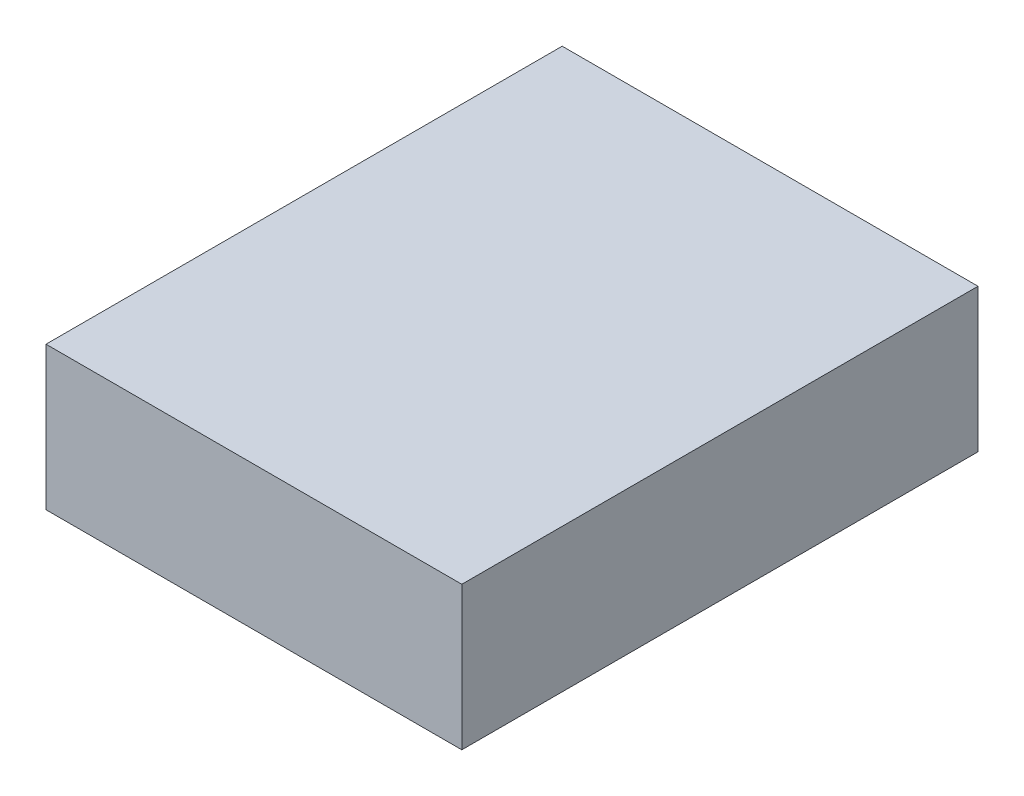
ISO-10303-21;
HEADER;
FILE_DESCRIPTION(('STEP AP214'),'2;1');
FILE_NAME('part.step','',(''),(''),'','','');
FILE_SCHEMA(('AUTOMOTIVE_DESIGN { 1 0 10303 214 1 1 1 1 }'));
ENDSEC;
DATA;
#1=APPLICATION_CONTEXT('core data for automotive mechanical design processes');
#2=APPLICATION_PROTOCOL_DEFINITION('international standard','automotive_design',2000,#1);
#3=PRODUCT_CONTEXT('',#1,'mechanical');
#4=PRODUCT('Part','Part','',(#3));
#5=PRODUCT_RELATED_PRODUCT_CATEGORY('part','',(#4));
#6=PRODUCT_DEFINITION_FORMATION('','',#4);
#7=PRODUCT_DEFINITION_CONTEXT('part definition',#1,'design');
#8=PRODUCT_DEFINITION('design','',#6,#7);
#9=PRODUCT_DEFINITION_SHAPE('','',#8);
#10=(LENGTH_UNIT() NAMED_UNIT(*) SI_UNIT(.MILLI.,.METRE.));
#11=(NAMED_UNIT(*) PLANE_ANGLE_UNIT() SI_UNIT($,.RADIAN.));
#12=(NAMED_UNIT(*) SI_UNIT($,.STERADIAN.) SOLID_ANGLE_UNIT());
#13=UNCERTAINTY_MEASURE_WITH_UNIT(LENGTH_MEASURE(1.E-05),#10,'distance_accuracy_value','');
#14=(GEOMETRIC_REPRESENTATION_CONTEXT(3) GLOBAL_UNCERTAINTY_ASSIGNED_CONTEXT((#13)) GLOBAL_UNIT_ASSIGNED_CONTEXT((#10,
#11,#12)) REPRESENTATION_CONTEXT('',''));
#15=CARTESIAN_POINT('',(0.,0.,0.));
#16=DIRECTION('',(0.,0.,1.));
#17=DIRECTION('',(1.,0.,0.));
#18=AXIS2_PLACEMENT_3D('',#15,#16,#17);
#19=CARTESIAN_POINT('',(-0.72499982,0.2499995,0.));
#20=DIRECTION('',(0.,1.,0.));
#21=DIRECTION('',(0.,0.,1.));
#22=AXIS2_PLACEMENT_3D('',#19,#20,#21);
#23=PLANE('',#22);
#24=DIRECTION('',(0.,0.,-1.));
#25=VECTOR('',#24,1.);
#26=CARTESIAN_POINT('',(0.72499982,0.2499995,0.));
#27=LINE('',#26,#25);
#28=CARTESIAN_POINT('',(0.72499982,0.2499995,0.));
#29=VERTEX_POINT('',#28);
#30=CARTESIAN_POINT('',(0.72499982,0.2499995,1.79999894));
#31=VERTEX_POINT('',#30);
#32=EDGE_CURVE('E61',#29,#31,#27,.F.);
#33=ORIENTED_EDGE('',*,*,#32,.F.);
#34=DIRECTION('',(1.,0.,0.));
#35=VECTOR('',#34,1.);
#36=CARTESIAN_POINT('',(-0.72499982,0.2499995,0.));
#37=LINE('',#36,#35);
#38=CARTESIAN_POINT('',(-0.72499982,0.2499995,0.));
#39=VERTEX_POINT('',#38);
#40=EDGE_CURVE('E19',#29,#39,#37,.F.);
#41=ORIENTED_EDGE('',*,*,#40,.T.);
#42=DIRECTION('',(0.,0.,1.));
#43=VECTOR('',#42,1.);
#44=CARTESIAN_POINT('',(-0.72499982,0.2499995,0.));
#45=LINE('',#44,#43);
#46=CARTESIAN_POINT('',(-0.72499982,0.2499995,1.79999894));
#47=VERTEX_POINT('',#46);
#48=EDGE_CURVE('E68',#47,#39,#45,.F.);
#49=ORIENTED_EDGE('',*,*,#48,.F.);
#50=DIRECTION('',(1.,0.,0.));
#51=VECTOR('',#50,1.);
#52=CARTESIAN_POINT('',(0.72499982,0.2499995,1.79999894));
#53=LINE('',#52,#51);
#54=EDGE_CURVE('E55',#31,#47,#53,.F.);
#55=ORIENTED_EDGE('',*,*,#54,.F.);
#56=EDGE_LOOP('',(#33,#41,#49,#55));
#57=FACE_BOUND('',#56,.T.);
#58=ADVANCED_FACE('F16',(#57),#23,.T.);
#59=CARTESIAN_POINT('',(0.72499982,0.2499995,0.));
#60=DIRECTION('',(1.,0.,0.));
#61=DIRECTION('',(0.,0.,-1.));
#62=AXIS2_PLACEMENT_3D('',#59,#60,#61);
#63=PLANE('',#62);
#64=DIRECTION('',(0.,0.,-1.));
#65=VECTOR('',#64,1.);
#66=CARTESIAN_POINT('',(0.72499982,-0.2499995,0.));
#67=LINE('',#66,#65);
#68=CARTESIAN_POINT('',(0.72499982,-0.2499995,0.));
#69=VERTEX_POINT('',#68);
#70=CARTESIAN_POINT('',(0.72499982,-0.2499995,1.79999894));
#71=VERTEX_POINT('',#70);
#72=EDGE_CURVE('E82',#69,#71,#67,.F.);
#73=ORIENTED_EDGE('',*,*,#72,.F.);
#74=DIRECTION('',(0.,1.,0.));
#75=VECTOR('',#74,1.);
#76=CARTESIAN_POINT('',(0.72499982,-0.2499995,0.));
#77=LINE('',#76,#75);
#78=EDGE_CURVE('E66',#69,#29,#77,.T.);
#79=ORIENTED_EDGE('',*,*,#78,.T.);
#80=ORIENTED_EDGE('',*,*,#32,.T.);
#81=DIRECTION('',(0.,1.,0.));
#82=VECTOR('',#81,1.);
#83=CARTESIAN_POINT('',(0.72499982,-0.2499995,1.79999894));
#84=LINE('',#83,#82);
#85=EDGE_CURVE('E63',#71,#31,#84,.T.);
#86=ORIENTED_EDGE('',*,*,#85,.F.);
#87=EDGE_LOOP('',(#73,#79,#80,#86));
#88=FACE_BOUND('',#87,.T.);
#89=ADVANCED_FACE('F62',(#88),#63,.T.);
#90=CARTESIAN_POINT('',(0.72499982,-0.2499995,1.79999894));
#91=DIRECTION('',(0.,0.,1.));
#92=DIRECTION('',(1.,0.,0.));
#93=AXIS2_PLACEMENT_3D('',#90,#91,#92);
#94=PLANE('',#93);
#95=DIRECTION('',(0.,1.,0.));
#96=VECTOR('',#95,1.);
#97=CARTESIAN_POINT('',(-0.72499982,-0.2499995,1.79999894));
#98=LINE('',#97,#96);
#99=CARTESIAN_POINT('',(-0.72499982,-0.2499995,1.79999894));
#100=VERTEX_POINT('',#99);
#101=EDGE_CURVE('E70',#100,#47,#98,.T.);
#102=ORIENTED_EDGE('',*,*,#101,.F.);
#103=DIRECTION('',(1.,0.,0.));
#104=VECTOR('',#103,1.);
#105=CARTESIAN_POINT('',(0.72499982,-0.2499995,1.79999894));
#106=LINE('',#105,#104);
#107=EDGE_CURVE('E74',#71,#100,#106,.F.);
#108=ORIENTED_EDGE('',*,*,#107,.F.);
#109=ORIENTED_EDGE('',*,*,#85,.T.);
#110=ORIENTED_EDGE('',*,*,#54,.T.);
#111=EDGE_LOOP('',(#102,#108,#109,#110));
#112=FACE_BOUND('',#111,.T.);
#113=ADVANCED_FACE('F72',(#112),#94,.T.);
#114=CARTESIAN_POINT('',(-0.72499982,-0.2499995,0.));
#115=DIRECTION('',(-1.,0.,0.));
#116=DIRECTION('',(0.,0.,1.));
#117=AXIS2_PLACEMENT_3D('',#114,#115,#116);
#118=PLANE('',#117);
#119=ORIENTED_EDGE('',*,*,#48,.T.);
#120=DIRECTION('',(0.,1.,0.));
#121=VECTOR('',#120,1.);
#122=CARTESIAN_POINT('',(-0.72499982,-0.2499995,0.));
#123=LINE('',#122,#121);
#124=CARTESIAN_POINT('',(-0.72499982,-0.2499995,0.));
#125=VERTEX_POINT('',#124);
#126=EDGE_CURVE('E34',#39,#125,#123,.F.);
#127=ORIENTED_EDGE('',*,*,#126,.T.);
#128=DIRECTION('',(0.,0.,-1.));
#129=VECTOR('',#128,1.);
#130=CARTESIAN_POINT('',(-0.72499982,-0.2499995,0.));
#131=LINE('',#130,#129);
#132=EDGE_CURVE('E25',#100,#125,#131,.T.);
#133=ORIENTED_EDGE('',*,*,#132,.F.);
#134=ORIENTED_EDGE('',*,*,#101,.T.);
#135=EDGE_LOOP('',(#119,#127,#133,#134));
#136=FACE_BOUND('',#135,.T.);
#137=ADVANCED_FACE('F88',(#136),#118,.T.);
#138=CARTESIAN_POINT('',(0.72499982,-0.2499995,0.));
#139=DIRECTION('',(0.,0.,1.));
#140=DIRECTION('',(1.,0.,0.));
#141=AXIS2_PLACEMENT_3D('',#138,#139,#140);
#142=PLANE('',#141);
#143=ORIENTED_EDGE('',*,*,#126,.F.);
#144=ORIENTED_EDGE('',*,*,#40,.F.);
#145=ORIENTED_EDGE('',*,*,#78,.F.);
#146=DIRECTION('',(1.,0.,0.));
#147=VECTOR('',#146,1.);
#148=CARTESIAN_POINT('',(0.72499982,-0.2499995,0.));
#149=LINE('',#148,#147);
#150=EDGE_CURVE('E11',#125,#69,#149,.T.);
#151=ORIENTED_EDGE('',*,*,#150,.F.);
#152=EDGE_LOOP('',(#143,#144,#145,#151));
#153=FACE_BOUND('',#152,.T.);
#154=ADVANCED_FACE('F90',(#153),#142,.F.);
#155=CARTESIAN_POINT('',(0.72499982,-0.2499995,0.));
#156=DIRECTION('',(0.,-1.,0.));
#157=DIRECTION('',(0.,0.,-1.));
#158=AXIS2_PLACEMENT_3D('',#155,#156,#157);
#159=PLANE('',#158);
#160=ORIENTED_EDGE('',*,*,#132,.T.);
#161=ORIENTED_EDGE('',*,*,#150,.T.);
#162=ORIENTED_EDGE('',*,*,#72,.T.);
#163=ORIENTED_EDGE('',*,*,#107,.T.);
#164=EDGE_LOOP('',(#160,#161,#162,#163));
#165=FACE_BOUND('',#164,.T.);
#166=ADVANCED_FACE('F87',(#165),#159,.T.);
#167=CLOSED_SHELL('',(#58,#89,#113,#137,#154,#166));
#168=MANIFOLD_SOLID_BREP('B1',#167);
#169=ADVANCED_BREP_SHAPE_REPRESENTATION('',(#18,#168),#14);
#170=SHAPE_DEFINITION_REPRESENTATION(#9,#169);
ENDSEC;
END-ISO-10303-21;
